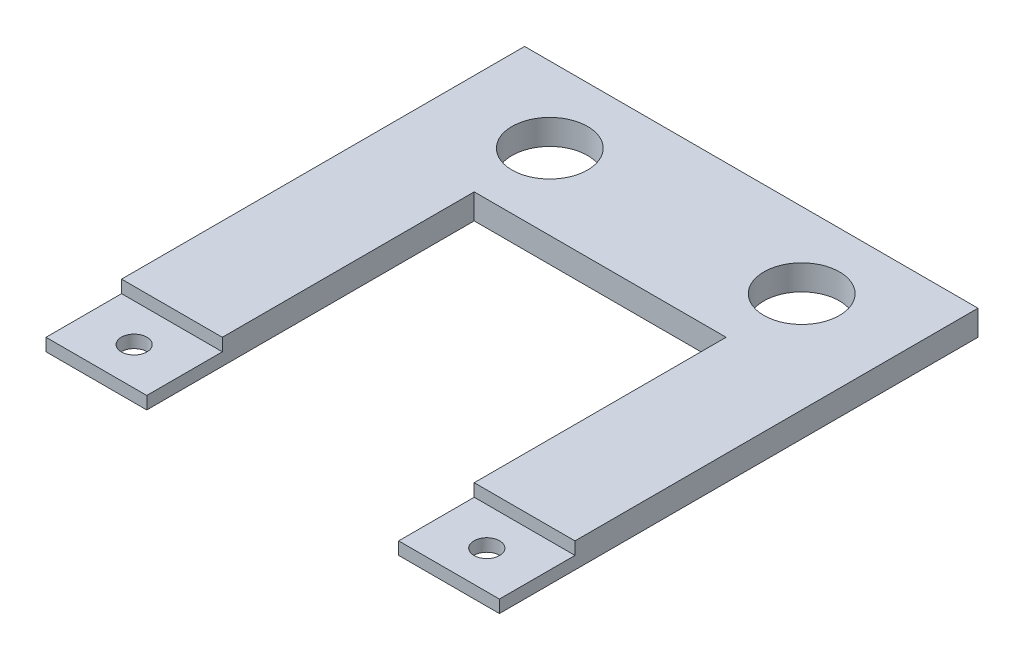
ISO-10303-21;
HEADER;
FILE_DESCRIPTION(('STEP AP214'),'2;1');
FILE_NAME('part.step','',(''),(''),'','','');
FILE_SCHEMA(('AUTOMOTIVE_DESIGN { 1 0 10303 214 1 1 1 1 }'));
ENDSEC;
DATA;
#1=APPLICATION_CONTEXT('core data for automotive mechanical design processes');
#2=APPLICATION_PROTOCOL_DEFINITION('international standard','automotive_design',2000,#1);
#3=PRODUCT_CONTEXT('',#1,'mechanical');
#4=PRODUCT('Part','Part','',(#3));
#5=PRODUCT_RELATED_PRODUCT_CATEGORY('part','',(#4));
#6=PRODUCT_DEFINITION_FORMATION('','',#4);
#7=PRODUCT_DEFINITION_CONTEXT('part definition',#1,'design');
#8=PRODUCT_DEFINITION('design','',#6,#7);
#9=PRODUCT_DEFINITION_SHAPE('','',#8);
#10=(LENGTH_UNIT() NAMED_UNIT(*) SI_UNIT(.MILLI.,.METRE.));
#11=(NAMED_UNIT(*) PLANE_ANGLE_UNIT() SI_UNIT($,.RADIAN.));
#12=(NAMED_UNIT(*) SI_UNIT($,.STERADIAN.) SOLID_ANGLE_UNIT());
#13=UNCERTAINTY_MEASURE_WITH_UNIT(LENGTH_MEASURE(1.E-05),#10,'distance_accuracy_value','');
#14=(GEOMETRIC_REPRESENTATION_CONTEXT(3) GLOBAL_UNCERTAINTY_ASSIGNED_CONTEXT((#13)) GLOBAL_UNIT_ASSIGNED_CONTEXT((#10,
#11,#12)) REPRESENTATION_CONTEXT('',''));
#15=CARTESIAN_POINT('',(0.,0.,0.));
#16=DIRECTION('',(0.,0.,1.));
#17=DIRECTION('',(1.,0.,0.));
#18=AXIS2_PLACEMENT_3D('',#15,#16,#17);
#19=CARTESIAN_POINT('',(7.9375,0.79375,0.));
#20=DIRECTION('',(-1.,0.,0.));
#21=DIRECTION('',(0.,0.,1.));
#22=AXIS2_PLACEMENT_3D('',#19,#20,#21);
#23=PLANE('',#22);
#24=DIRECTION('',(0.,1.,0.));
#25=VECTOR('',#24,1.);
#26=CARTESIAN_POINT('',(7.9375,0.,10.31875));
#27=LINE('',#26,#25);
#28=CARTESIAN_POINT('',(7.9375,0.,10.31875));
#29=VERTEX_POINT('',#28);
#30=CARTESIAN_POINT('',(7.9375,0.79375,10.31875));
#31=VERTEX_POINT('',#30);
#32=EDGE_CURVE('E180',#29,#31,#27,.T.);
#33=ORIENTED_EDGE('',*,*,#32,.T.);
#34=DIRECTION('',(0.,0.,-1.));
#35=VECTOR('',#34,1.);
#36=CARTESIAN_POINT('',(7.9375,0.79375,0.));
#37=LINE('',#36,#35);
#38=CARTESIAN_POINT('',(7.9375,0.79375,-5.55625));
#39=VERTEX_POINT('',#38);
#40=EDGE_CURVE('E198',#31,#39,#37,.T.);
#41=ORIENTED_EDGE('',*,*,#40,.T.);
#42=DIRECTION('',(0.,-1.,0.));
#43=VECTOR('',#42,1.);
#44=CARTESIAN_POINT('',(7.9375,0.79375,-5.55625));
#45=LINE('',#44,#43);
#46=CARTESIAN_POINT('',(7.9375,-0.79375,-5.55625));
#47=VERTEX_POINT('',#46);
#48=EDGE_CURVE('E215',#39,#47,#45,.T.);
#49=ORIENTED_EDGE('',*,*,#48,.T.);
#50=DIRECTION('',(0.,0.,-1.));
#51=VECTOR('',#50,1.);
#52=CARTESIAN_POINT('',(7.9375,-0.79375,0.));
#53=LINE('',#52,#51);
#54=CARTESIAN_POINT('',(7.9375,-0.79375,15.08125));
#55=VERTEX_POINT('',#54);
#56=EDGE_CURVE('E183',#55,#47,#53,.T.);
#57=ORIENTED_EDGE('',*,*,#56,.F.);
#58=DIRECTION('',(0.,-1.,0.));
#59=VECTOR('',#58,1.);
#60=CARTESIAN_POINT('',(7.9375,0.79375,15.08125));
#61=LINE('',#60,#59);
#62=CARTESIAN_POINT('',(7.9375,0.,15.08125));
#63=VERTEX_POINT('',#62);
#64=EDGE_CURVE('E11',#63,#55,#61,.T.);
#65=ORIENTED_EDGE('',*,*,#64,.F.);
#66=DIRECTION('',(0.,0.,1.));
#67=VECTOR('',#66,1.);
#68=CARTESIAN_POINT('',(7.9375,0.,15.08125));
#69=LINE('',#68,#67);
#70=EDGE_CURVE('E185',#29,#63,#69,.T.);
#71=ORIENTED_EDGE('',*,*,#70,.F.);
#72=EDGE_LOOP('',(#33,#41,#49,#57,#65,#71));
#73=FACE_BOUND('',#72,.T.);
#74=ADVANCED_FACE('F35',(#73),#23,.T.);
#75=CARTESIAN_POINT('',(0.,0.79375,15.08125));
#76=DIRECTION('',(0.,0.,-1.));
#77=DIRECTION('',(-1.,0.,0.));
#78=AXIS2_PLACEMENT_3D('',#75,#76,#77);
#79=PLANE('',#78);
#80=DIRECTION('',(0.,-1.,0.));
#81=VECTOR('',#80,1.);
#82=CARTESIAN_POINT('',(14.2875,0.79375,15.08125));
#83=LINE('',#82,#81);
#84=CARTESIAN_POINT('',(14.2875,0.,15.08125));
#85=VERTEX_POINT('',#84);
#86=CARTESIAN_POINT('',(14.2875,-0.79375,15.08125));
#87=VERTEX_POINT('',#86);
#88=EDGE_CURVE('E43',#85,#87,#83,.T.);
#89=ORIENTED_EDGE('',*,*,#88,.F.);
#90=DIRECTION('',(1.,0.,0.));
#91=VECTOR('',#90,1.);
#92=CARTESIAN_POINT('',(7.9375,0.,15.08125));
#93=LINE('',#92,#91);
#94=EDGE_CURVE('E187',#63,#85,#93,.T.);
#95=ORIENTED_EDGE('',*,*,#94,.F.);
#96=ORIENTED_EDGE('',*,*,#64,.T.);
#97=DIRECTION('',(1.,0.,0.));
#98=VECTOR('',#97,1.);
#99=CARTESIAN_POINT('',(0.,-0.79375,15.08125));
#100=LINE('',#99,#98);
#101=EDGE_CURVE('E218',#55,#87,#100,.T.);
#102=ORIENTED_EDGE('',*,*,#101,.T.);
#103=EDGE_LOOP('',(#89,#95,#96,#102));
#104=FACE_BOUND('',#103,.T.);
#105=ADVANCED_FACE('F268',(#104),#79,.F.);
#106=CARTESIAN_POINT('',(14.2875,0.79375,0.));
#107=DIRECTION('',(1.,0.,0.));
#108=DIRECTION('',(0.,0.,-1.));
#109=AXIS2_PLACEMENT_3D('',#106,#107,#108);
#110=PLANE('',#109);
#111=DIRECTION('',(0.,1.,0.));
#112=VECTOR('',#111,1.);
#113=CARTESIAN_POINT('',(14.2875,0.,10.31875));
#114=LINE('',#113,#112);
#115=CARTESIAN_POINT('',(14.2875,0.,10.31875));
#116=VERTEX_POINT('',#115);
#117=CARTESIAN_POINT('',(14.2875,0.79375,10.31875));
#118=VERTEX_POINT('',#117);
#119=EDGE_CURVE('E59',#116,#118,#114,.T.);
#120=ORIENTED_EDGE('',*,*,#119,.F.);
#121=DIRECTION('',(0.,0.,-1.));
#122=VECTOR('',#121,1.);
#123=CARTESIAN_POINT('',(14.2875,0.,15.08125));
#124=LINE('',#123,#122);
#125=EDGE_CURVE('E189',#85,#116,#124,.T.);
#126=ORIENTED_EDGE('',*,*,#125,.F.);
#127=ORIENTED_EDGE('',*,*,#88,.T.);
#128=DIRECTION('',(0.,0.,1.));
#129=VECTOR('',#128,1.);
#130=CARTESIAN_POINT('',(14.2875,-0.79375,0.));
#131=LINE('',#130,#129);
#132=CARTESIAN_POINT('',(14.2875,-0.79375,-15.08125));
#133=VERTEX_POINT('',#132);
#134=EDGE_CURVE('E221',#133,#87,#131,.T.);
#135=ORIENTED_EDGE('',*,*,#134,.F.);
#136=DIRECTION('',(0.,-1.,0.));
#137=VECTOR('',#136,1.);
#138=CARTESIAN_POINT('',(14.2875,0.79375,-15.08125));
#139=LINE('',#138,#137);
#140=CARTESIAN_POINT('',(14.2875,0.79375,-15.08125));
#141=VERTEX_POINT('',#140);
#142=EDGE_CURVE('E152',#141,#133,#139,.T.);
#143=ORIENTED_EDGE('',*,*,#142,.F.);
#144=DIRECTION('',(0.,0.,1.));
#145=VECTOR('',#144,1.);
#146=CARTESIAN_POINT('',(14.2875,0.79375,0.));
#147=LINE('',#146,#145);
#148=EDGE_CURVE('E200',#141,#118,#147,.T.);
#149=ORIENTED_EDGE('',*,*,#148,.T.);
#150=EDGE_LOOP('',(#120,#126,#127,#135,#143,#149));
#151=FACE_BOUND('',#150,.T.);
#152=ADVANCED_FACE('F263',(#151),#110,.T.);
#153=CARTESIAN_POINT('',(0.,0.79375,-15.08125));
#154=DIRECTION('',(0.,0.,-1.));
#155=DIRECTION('',(-1.,0.,0.));
#156=AXIS2_PLACEMENT_3D('',#153,#154,#155);
#157=PLANE('',#156);
#158=DIRECTION('',(1.,0.,0.));
#159=VECTOR('',#158,1.);
#160=CARTESIAN_POINT('',(0.,-0.79375,-15.08125));
#161=LINE('',#160,#159);
#162=CARTESIAN_POINT('',(-14.2875,-0.79375,-15.08125));
#163=VERTEX_POINT('',#162);
#164=EDGE_CURVE('E225',#163,#133,#161,.T.);
#165=ORIENTED_EDGE('',*,*,#164,.F.);
#166=DIRECTION('',(0.,-1.,0.));
#167=VECTOR('',#166,1.);
#168=CARTESIAN_POINT('',(-14.2875,0.79375,-15.08125));
#169=LINE('',#168,#167);
#170=CARTESIAN_POINT('',(-14.2875,0.79375,-15.08125));
#171=VERTEX_POINT('',#170);
#172=EDGE_CURVE('E150',#171,#163,#169,.T.);
#173=ORIENTED_EDGE('',*,*,#172,.F.);
#174=DIRECTION('',(1.,0.,0.));
#175=VECTOR('',#174,1.);
#176=CARTESIAN_POINT('',(0.,0.79375,-15.08125));
#177=LINE('',#176,#175);
#178=EDGE_CURVE('E204',#171,#141,#177,.T.);
#179=ORIENTED_EDGE('',*,*,#178,.T.);
#180=ORIENTED_EDGE('',*,*,#142,.T.);
#181=EDGE_LOOP('',(#165,#173,#179,#180));
#182=FACE_BOUND('',#181,.T.);
#183=ADVANCED_FACE('F260',(#182),#157,.T.);
#184=CARTESIAN_POINT('',(-14.2875,0.79375,0.));
#185=DIRECTION('',(1.,0.,0.));
#186=DIRECTION('',(0.,0.,-1.));
#187=AXIS2_PLACEMENT_3D('',#184,#185,#186);
#188=PLANE('',#187);
#189=DIRECTION('',(0.,0.,1.));
#190=VECTOR('',#189,1.);
#191=CARTESIAN_POINT('',(-14.2875,0.,15.08125));
#192=LINE('',#191,#190);
#193=CARTESIAN_POINT('',(-14.2875,0.,10.31875));
#194=VERTEX_POINT('',#193);
#195=CARTESIAN_POINT('',(-14.2875,0.,15.08125));
#196=VERTEX_POINT('',#195);
#197=EDGE_CURVE('E126',#194,#196,#192,.T.);
#198=ORIENTED_EDGE('',*,*,#197,.F.);
#199=DIRECTION('',(0.,1.,0.));
#200=VECTOR('',#199,1.);
#201=CARTESIAN_POINT('',(-14.2875,0.,10.31875));
#202=LINE('',#201,#200);
#203=CARTESIAN_POINT('',(-14.2875,0.79375,10.31875));
#204=VERTEX_POINT('',#203);
#205=EDGE_CURVE('E181',#194,#204,#202,.T.);
#206=ORIENTED_EDGE('',*,*,#205,.T.);
#207=DIRECTION('',(0.,0.,1.));
#208=VECTOR('',#207,1.);
#209=CARTESIAN_POINT('',(-14.2875,0.79375,0.));
#210=LINE('',#209,#208);
#211=EDGE_CURVE('E207',#171,#204,#210,.T.);
#212=ORIENTED_EDGE('',*,*,#211,.F.);
#213=ORIENTED_EDGE('',*,*,#172,.T.);
#214=DIRECTION('',(0.,0.,1.));
#215=VECTOR('',#214,1.);
#216=CARTESIAN_POINT('',(-14.2875,-0.79375,0.));
#217=LINE('',#216,#215);
#218=CARTESIAN_POINT('',(-14.2875,-0.79375,15.08125));
#219=VERTEX_POINT('',#218);
#220=EDGE_CURVE('E148',#163,#219,#217,.T.);
#221=ORIENTED_EDGE('',*,*,#220,.T.);
#222=DIRECTION('',(0.,-1.,0.));
#223=VECTOR('',#222,1.);
#224=CARTESIAN_POINT('',(-14.2875,0.79375,15.08125));
#225=LINE('',#224,#223);
#226=EDGE_CURVE('E141',#196,#219,#225,.T.);
#227=ORIENTED_EDGE('',*,*,#226,.F.);
#228=EDGE_LOOP('',(#198,#206,#212,#213,#221,#227));
#229=FACE_BOUND('',#228,.T.);
#230=ADVANCED_FACE('F146',(#229),#188,.F.);
#231=DIRECTION('',(0.,-1.,0.));
#232=VECTOR('',#231,1.);
#233=CARTESIAN_POINT('',(-7.9375,0.79375,15.08125));
#234=LINE('',#233,#232);
#235=CARTESIAN_POINT('',(-7.9375,0.,15.08125));
#236=VERTEX_POINT('',#235);
#237=CARTESIAN_POINT('',(-7.9375,-0.79375,15.08125));
#238=VERTEX_POINT('',#237);
#239=EDGE_CURVE('E143',#236,#238,#234,.T.);
#240=ORIENTED_EDGE('',*,*,#239,.F.);
#241=DIRECTION('',(1.,0.,0.));
#242=VECTOR('',#241,1.);
#243=CARTESIAN_POINT('',(-14.2875,0.,15.08125));
#244=LINE('',#243,#242);
#245=EDGE_CURVE('E129',#196,#236,#244,.T.);
#246=ORIENTED_EDGE('',*,*,#245,.F.);
#247=ORIENTED_EDGE('',*,*,#226,.T.);
#248=EDGE_CURVE('E222',#219,#238,#100,.T.);
#249=ORIENTED_EDGE('',*,*,#248,.T.);
#250=EDGE_LOOP('',(#240,#246,#247,#249));
#251=FACE_BOUND('',#250,.T.);
#252=ADVANCED_FACE('F139',(#251),#79,.F.);
#253=CARTESIAN_POINT('',(-7.9375,0.79375,0.));
#254=DIRECTION('',(-1.,0.,0.));
#255=DIRECTION('',(0.,0.,1.));
#256=AXIS2_PLACEMENT_3D('',#253,#254,#255);
#257=PLANE('',#256);
#258=DIRECTION('',(0.,0.,-1.));
#259=VECTOR('',#258,1.);
#260=CARTESIAN_POINT('',(-7.9375,0.79375,0.));
#261=LINE('',#260,#259);
#262=CARTESIAN_POINT('',(-7.9375,0.79375,10.31875));
#263=VERTEX_POINT('',#262);
#264=CARTESIAN_POINT('',(-7.9375,0.79375,-5.55625));
#265=VERTEX_POINT('',#264);
#266=EDGE_CURVE('E210',#263,#265,#261,.T.);
#267=ORIENTED_EDGE('',*,*,#266,.F.);
#268=DIRECTION('',(0.,1.,0.));
#269=VECTOR('',#268,1.);
#270=CARTESIAN_POINT('',(-7.9375,0.,10.31875));
#271=LINE('',#270,#269);
#272=CARTESIAN_POINT('',(-7.9375,0.,10.31875));
#273=VERTEX_POINT('',#272);
#274=EDGE_CURVE('E51',#273,#263,#271,.T.);
#275=ORIENTED_EDGE('',*,*,#274,.F.);
#276=DIRECTION('',(0.,0.,-1.));
#277=VECTOR('',#276,1.);
#278=CARTESIAN_POINT('',(-7.9375,0.,15.08125));
#279=LINE('',#278,#277);
#280=EDGE_CURVE('E144',#236,#273,#279,.T.);
#281=ORIENTED_EDGE('',*,*,#280,.F.);
#282=ORIENTED_EDGE('',*,*,#239,.T.);
#283=DIRECTION('',(0.,0.,-1.));
#284=VECTOR('',#283,1.);
#285=CARTESIAN_POINT('',(-7.9375,-0.79375,0.));
#286=LINE('',#285,#284);
#287=CARTESIAN_POINT('',(-7.9375,-0.79375,-5.55625));
#288=VERTEX_POINT('',#287);
#289=EDGE_CURVE('E229',#238,#288,#286,.T.);
#290=ORIENTED_EDGE('',*,*,#289,.T.);
#291=DIRECTION('',(0.,-1.,0.));
#292=VECTOR('',#291,1.);
#293=CARTESIAN_POINT('',(-7.9375,0.79375,-5.55625));
#294=LINE('',#293,#292);
#295=EDGE_CURVE('E154',#265,#288,#294,.T.);
#296=ORIENTED_EDGE('',*,*,#295,.F.);
#297=EDGE_LOOP('',(#267,#275,#281,#282,#290,#296));
#298=FACE_BOUND('',#297,.T.);
#299=ADVANCED_FACE('F253',(#298),#257,.F.);
#300=CARTESIAN_POINT('',(0.,0.79375,-5.55625));
#301=DIRECTION('',(0.,0.,-1.));
#302=DIRECTION('',(-1.,0.,0.));
#303=AXIS2_PLACEMENT_3D('',#300,#301,#302);
#304=PLANE('',#303);
#305=DIRECTION('',(1.,0.,0.));
#306=VECTOR('',#305,1.);
#307=CARTESIAN_POINT('',(0.,-0.79375,-5.55625));
#308=LINE('',#307,#306);
#309=EDGE_CURVE('E201',#288,#47,#308,.T.);
#310=ORIENTED_EDGE('',*,*,#309,.T.);
#311=ORIENTED_EDGE('',*,*,#48,.F.);
#312=DIRECTION('',(1.,0.,0.));
#313=VECTOR('',#312,1.);
#314=CARTESIAN_POINT('',(0.,0.79375,-5.55625));
#315=LINE('',#314,#313);
#316=EDGE_CURVE('E212',#265,#39,#315,.T.);
#317=ORIENTED_EDGE('',*,*,#316,.F.);
#318=ORIENTED_EDGE('',*,*,#295,.T.);
#319=EDGE_LOOP('',(#310,#311,#317,#318));
#320=FACE_BOUND('',#319,.T.);
#321=ADVANCED_FACE('F238',(#320),#304,.F.);
#322=CARTESIAN_POINT('',(0.,0.79375,0.));
#323=DIRECTION('',(0.,1.,0.));
#324=DIRECTION('',(0.,0.,1.));
#325=AXIS2_PLACEMENT_3D('',#322,#323,#324);
#326=PLANE('',#325);
#327=CARTESIAN_POINT('',(-7.9375,0.79375,-10.31875));
#328=DIRECTION('',(0.,1.,0.));
#329=DIRECTION('',(0.,0.,1.));
#330=AXIS2_PLACEMENT_3D('',#327,#328,#329);
#331=CIRCLE('',#330,2.38125);
#332=CARTESIAN_POINT('',(-7.9375,0.79375,-7.9375));
#333=VERTEX_POINT('',#332);
#334=EDGE_CURVE('E172',#333,#333,#331,.T.);
#335=ORIENTED_EDGE('',*,*,#334,.F.);
#336=EDGE_LOOP('',(#335));
#337=FACE_BOUND('',#336,.T.);
#338=CARTESIAN_POINT('',(7.93749999999993,0.79375,-10.31875));
#339=DIRECTION('',(0.,1.,0.));
#340=DIRECTION('',(0.,0.,1.));
#341=AXIS2_PLACEMENT_3D('',#338,#339,#340);
#342=CIRCLE('',#341,2.38125000000001);
#343=CARTESIAN_POINT('',(7.93749999999993,0.79375,-7.93749999999999));
#344=VERTEX_POINT('',#343);
#345=EDGE_CURVE('E420',#344,#344,#342,.T.);
#346=ORIENTED_EDGE('',*,*,#345,.F.);
#347=EDGE_LOOP('',(#346));
#348=FACE_BOUND('',#347,.T.);
#349=DIRECTION('',(-1.,0.,0.));
#350=VECTOR('',#349,1.);
#351=CARTESIAN_POINT('',(-14.2875,0.79375,10.31875));
#352=LINE('',#351,#350);
#353=EDGE_CURVE('E135',#263,#204,#352,.T.);
#354=ORIENTED_EDGE('',*,*,#353,.F.);
#355=ORIENTED_EDGE('',*,*,#266,.T.);
#356=ORIENTED_EDGE('',*,*,#316,.T.);
#357=ORIENTED_EDGE('',*,*,#40,.F.);
#358=DIRECTION('',(-1.,0.,0.));
#359=VECTOR('',#358,1.);
#360=CARTESIAN_POINT('',(7.9375,0.79375,10.31875));
#361=LINE('',#360,#359);
#362=EDGE_CURVE('E165',#118,#31,#361,.T.);
#363=ORIENTED_EDGE('',*,*,#362,.F.);
#364=ORIENTED_EDGE('',*,*,#148,.F.);
#365=ORIENTED_EDGE('',*,*,#178,.F.);
#366=ORIENTED_EDGE('',*,*,#211,.T.);
#367=EDGE_LOOP('',(#354,#355,#356,#357,#363,#364,#365,#366));
#368=FACE_BOUND('',#367,.T.);
#369=ADVANCED_FACE('F252',(#337,#348,#368),#326,.T.);
#370=CARTESIAN_POINT('',(0.,-0.79375,0.));
#371=DIRECTION('',(0.,1.,0.));
#372=DIRECTION('',(0.,0.,1.));
#373=AXIS2_PLACEMENT_3D('',#370,#371,#372);
#374=PLANE('',#373);
#375=CARTESIAN_POINT('',(-7.9375,-0.79375,-10.31875));
#376=DIRECTION('',(0.,1.,0.));
#377=DIRECTION('',(0.,0.,1.));
#378=AXIS2_PLACEMENT_3D('',#375,#376,#377);
#379=CIRCLE('',#378,2.38125);
#380=CARTESIAN_POINT('',(-7.9375,-0.79375,-7.9375));
#381=VERTEX_POINT('',#380);
#382=EDGE_CURVE('E167',#381,#381,#379,.F.);
#383=ORIENTED_EDGE('',*,*,#382,.F.);
#384=EDGE_LOOP('',(#383));
#385=FACE_BOUND('',#384,.T.);
#386=CARTESIAN_POINT('',(11.1125000000001,-0.79375,12.7));
#387=DIRECTION('',(0.,1.,0.));
#388=DIRECTION('',(0.,0.,1.));
#389=AXIS2_PLACEMENT_3D('',#386,#387,#388);
#390=CIRCLE('',#389,0.806450000000001);
#391=CARTESIAN_POINT('',(11.1125000000001,-0.79375,13.50645));
#392=VERTEX_POINT('',#391);
#393=EDGE_CURVE('E175',#392,#392,#390,.F.);
#394=ORIENTED_EDGE('',*,*,#393,.F.);
#395=EDGE_LOOP('',(#394));
#396=FACE_BOUND('',#395,.T.);
#397=CARTESIAN_POINT('',(7.93749999999993,-0.79375,-10.31875));
#398=DIRECTION('',(0.,1.,0.));
#399=DIRECTION('',(0.,0.,1.));
#400=AXIS2_PLACEMENT_3D('',#397,#398,#399);
#401=CIRCLE('',#400,2.38125000000001);
#402=CARTESIAN_POINT('',(7.93749999999993,-0.79375,-7.93749999999999));
#403=VERTEX_POINT('',#402);
#404=EDGE_CURVE('E416',#403,#403,#401,.F.);
#405=ORIENTED_EDGE('',*,*,#404,.F.);
#406=EDGE_LOOP('',(#405));
#407=FACE_BOUND('',#406,.T.);
#408=CARTESIAN_POINT('',(-11.1125,-0.79375,12.7));
#409=DIRECTION('',(0.,1.,0.));
#410=DIRECTION('',(0.,0.,1.));
#411=AXIS2_PLACEMENT_3D('',#408,#409,#410);
#412=CIRCLE('',#411,0.806450000000001);
#413=CARTESIAN_POINT('',(-11.1125,-0.79375,13.50645));
#414=VERTEX_POINT('',#413);
#415=EDGE_CURVE('E161',#414,#414,#412,.F.);
#416=ORIENTED_EDGE('',*,*,#415,.F.);
#417=EDGE_LOOP('',(#416));
#418=FACE_BOUND('',#417,.T.);
#419=ORIENTED_EDGE('',*,*,#56,.T.);
#420=ORIENTED_EDGE('',*,*,#309,.F.);
#421=ORIENTED_EDGE('',*,*,#289,.F.);
#422=ORIENTED_EDGE('',*,*,#248,.F.);
#423=ORIENTED_EDGE('',*,*,#220,.F.);
#424=ORIENTED_EDGE('',*,*,#164,.T.);
#425=ORIENTED_EDGE('',*,*,#134,.T.);
#426=ORIENTED_EDGE('',*,*,#101,.F.);
#427=EDGE_LOOP('',(#419,#420,#421,#422,#423,#424,#425,#426));
#428=FACE_BOUND('',#427,.T.);
#429=ADVANCED_FACE('F244',(#385,#396,#407,#418,#428),#374,.F.);
#430=CARTESIAN_POINT('',(7.9375,0.,10.31875));
#431=DIRECTION('',(0.,0.,-1.));
#432=DIRECTION('',(-1.,0.,0.));
#433=AXIS2_PLACEMENT_3D('',#430,#431,#432);
#434=PLANE('',#433);
#435=ORIENTED_EDGE('',*,*,#362,.T.);
#436=ORIENTED_EDGE('',*,*,#32,.F.);
#437=DIRECTION('',(-1.,0.,0.));
#438=VECTOR('',#437,1.);
#439=CARTESIAN_POINT('',(7.9375,0.,10.31875));
#440=LINE('',#439,#438);
#441=EDGE_CURVE('E191',#116,#29,#440,.T.);
#442=ORIENTED_EDGE('',*,*,#441,.F.);
#443=ORIENTED_EDGE('',*,*,#119,.T.);
#444=EDGE_LOOP('',(#435,#436,#442,#443));
#445=FACE_BOUND('',#444,.T.);
#446=ADVANCED_FACE('F271',(#445),#434,.F.);
#447=CARTESIAN_POINT('',(0.,0.,0.));
#448=DIRECTION('',(0.,-1.,0.));
#449=DIRECTION('',(0.,0.,-1.));
#450=AXIS2_PLACEMENT_3D('',#447,#448,#449);
#451=PLANE('',#450);
#452=CARTESIAN_POINT('',(11.1125000000001,0.,12.7));
#453=DIRECTION('',(0.,-1.,0.));
#454=DIRECTION('',(0.,0.,-1.));
#455=AXIS2_PLACEMENT_3D('',#452,#453,#454);
#456=CIRCLE('',#455,0.806450000000001);
#457=CARTESIAN_POINT('',(11.1125000000001,0.,11.89355));
#458=VERTEX_POINT('',#457);
#459=EDGE_CURVE('E38',#458,#458,#456,.T.);
#460=ORIENTED_EDGE('',*,*,#459,.T.);
#461=EDGE_LOOP('',(#460));
#462=FACE_BOUND('',#461,.T.);
#463=ORIENTED_EDGE('',*,*,#70,.T.);
#464=ORIENTED_EDGE('',*,*,#94,.T.);
#465=ORIENTED_EDGE('',*,*,#125,.T.);
#466=ORIENTED_EDGE('',*,*,#441,.T.);
#467=EDGE_LOOP('',(#463,#464,#465,#466));
#468=FACE_BOUND('',#467,.T.);
#469=ADVANCED_FACE('F270',(#462,#468),#451,.F.);
#470=CARTESIAN_POINT('',(-14.2875,0.,10.31875));
#471=DIRECTION('',(0.,0.,-1.));
#472=DIRECTION('',(-1.,0.,0.));
#473=AXIS2_PLACEMENT_3D('',#470,#471,#472);
#474=PLANE('',#473);
#475=ORIENTED_EDGE('',*,*,#353,.T.);
#476=ORIENTED_EDGE('',*,*,#205,.F.);
#477=DIRECTION('',(-1.,0.,0.));
#478=VECTOR('',#477,1.);
#479=CARTESIAN_POINT('',(-14.2875,0.,10.31875));
#480=LINE('',#479,#478);
#481=EDGE_CURVE('E131',#273,#194,#480,.T.);
#482=ORIENTED_EDGE('',*,*,#481,.F.);
#483=ORIENTED_EDGE('',*,*,#274,.T.);
#484=EDGE_LOOP('',(#475,#476,#482,#483));
#485=FACE_BOUND('',#484,.T.);
#486=ADVANCED_FACE('F254',(#485),#474,.F.);
#487=CARTESIAN_POINT('',(0.,0.,0.));
#488=DIRECTION('',(0.,-1.,0.));
#489=DIRECTION('',(0.,0.,-1.));
#490=AXIS2_PLACEMENT_3D('',#487,#488,#489);
#491=PLANE('',#490);
#492=CARTESIAN_POINT('',(-11.1125,0.,12.7));
#493=DIRECTION('',(0.,-1.,0.));
#494=DIRECTION('',(0.,0.,-1.));
#495=AXIS2_PLACEMENT_3D('',#492,#493,#494);
#496=CIRCLE('',#495,0.806450000000001);
#497=CARTESIAN_POINT('',(-11.1125,0.,11.89355));
#498=VERTEX_POINT('',#497);
#499=EDGE_CURVE('E159',#498,#498,#496,.T.);
#500=ORIENTED_EDGE('',*,*,#499,.T.);
#501=EDGE_LOOP('',(#500));
#502=FACE_BOUND('',#501,.T.);
#503=ORIENTED_EDGE('',*,*,#197,.T.);
#504=ORIENTED_EDGE('',*,*,#245,.T.);
#505=ORIENTED_EDGE('',*,*,#280,.T.);
#506=ORIENTED_EDGE('',*,*,#481,.T.);
#507=EDGE_LOOP('',(#503,#504,#505,#506));
#508=FACE_BOUND('',#507,.T.);
#509=ADVANCED_FACE('F128',(#502,#508),#491,.F.);
#510=CARTESIAN_POINT('',(-11.1125,-7.52894209080189,12.7));
#511=DIRECTION('',(0.,1.,0.));
#512=DIRECTION('',(0.,0.,1.));
#513=AXIS2_PLACEMENT_3D('',#510,#511,#512);
#514=CYLINDRICAL_SURFACE('',#513,0.806450000000001);
#515=ORIENTED_EDGE('',*,*,#415,.T.);
#516=EDGE_LOOP('',(#515));
#517=FACE_BOUND('',#516,.T.);
#518=ORIENTED_EDGE('',*,*,#499,.F.);
#519=EDGE_LOOP('',(#518));
#520=FACE_BOUND('',#519,.T.);
#521=ADVANCED_FACE('F368',(#517,#520),#514,.F.);
#522=CARTESIAN_POINT('',(11.1125000000001,-7.52894209080189,12.7));
#523=DIRECTION('',(0.,1.,0.));
#524=DIRECTION('',(0.,0.,1.));
#525=AXIS2_PLACEMENT_3D('',#522,#523,#524);
#526=CYLINDRICAL_SURFACE('',#525,0.806450000000001);
#527=ORIENTED_EDGE('',*,*,#393,.T.);
#528=EDGE_LOOP('',(#527));
#529=FACE_BOUND('',#528,.T.);
#530=ORIENTED_EDGE('',*,*,#459,.F.);
#531=EDGE_LOOP('',(#530));
#532=FACE_BOUND('',#531,.T.);
#533=ADVANCED_FACE('F377',(#529,#532),#526,.F.);
#534=CARTESIAN_POINT('',(7.93749999999993,-7.52894209080189,-10.31875));
#535=DIRECTION('',(0.,1.,0.));
#536=DIRECTION('',(0.,0.,1.));
#537=AXIS2_PLACEMENT_3D('',#534,#535,#536);
#538=CYLINDRICAL_SURFACE('',#537,2.38125000000001);
#539=ORIENTED_EDGE('',*,*,#404,.T.);
#540=EDGE_LOOP('',(#539));
#541=FACE_BOUND('',#540,.T.);
#542=ORIENTED_EDGE('',*,*,#345,.T.);
#543=EDGE_LOOP('',(#542));
#544=FACE_BOUND('',#543,.T.);
#545=ADVANCED_FACE('F386',(#541,#544),#538,.F.);
#546=CARTESIAN_POINT('',(-7.9375,-7.52894209080189,-10.31875));
#547=DIRECTION('',(0.,1.,0.));
#548=DIRECTION('',(0.,0.,1.));
#549=AXIS2_PLACEMENT_3D('',#546,#547,#548);
#550=CYLINDRICAL_SURFACE('',#549,2.38125);
#551=ORIENTED_EDGE('',*,*,#382,.T.);
#552=EDGE_LOOP('',(#551));
#553=FACE_BOUND('',#552,.T.);
#554=ORIENTED_EDGE('',*,*,#334,.T.);
#555=EDGE_LOOP('',(#554));
#556=FACE_BOUND('',#555,.T.);
#557=ADVANCED_FACE('F396',(#553,#556),#550,.F.);
#558=CLOSED_SHELL('',(#74,#105,#152,#183,#230,#252,#299,#321,#369,#429,#446,#469,#486,#509,#521,
#533,#545,#557));
#559=MANIFOLD_SOLID_BREP('B2',#558);
#560=ADVANCED_BREP_SHAPE_REPRESENTATION('',(#18,#559),#14);
#561=SHAPE_DEFINITION_REPRESENTATION(#9,#560);
ENDSEC;
END-ISO-10303-21;
